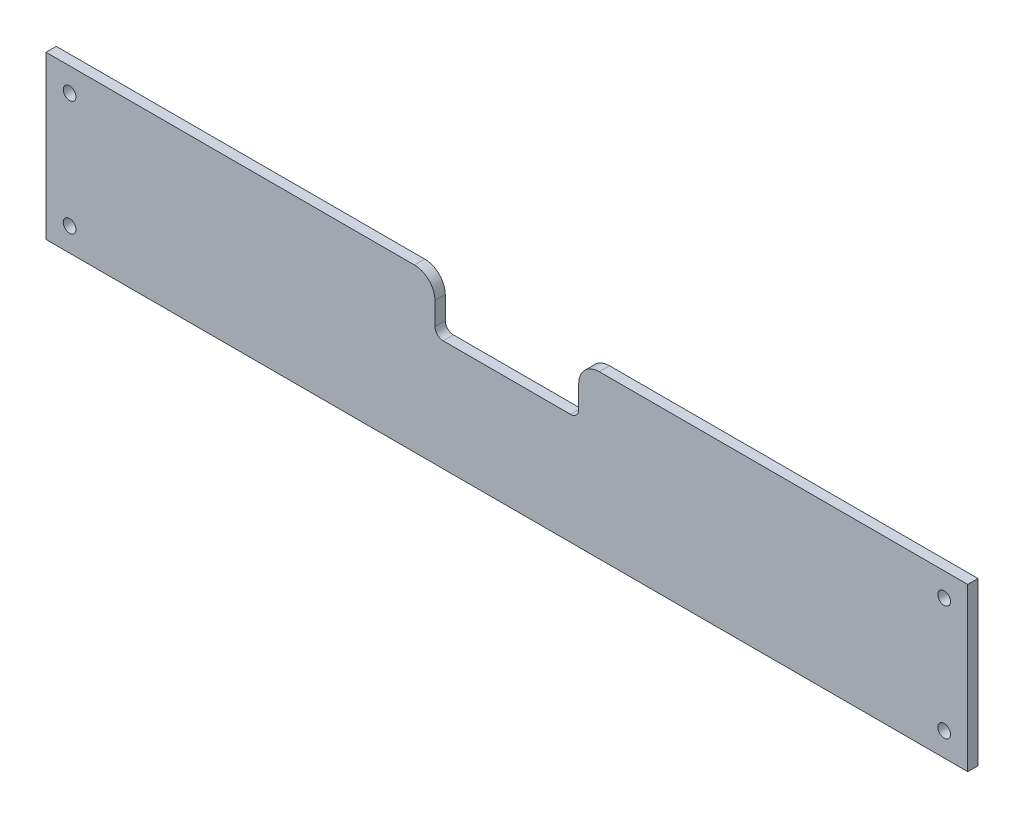
ISO-10303-21;
HEADER;
FILE_DESCRIPTION(('STEP AP214'),'2;1');
FILE_NAME('part.step','',(''),(''),'','','');
FILE_SCHEMA(('AUTOMOTIVE_DESIGN { 1 0 10303 214 1 1 1 1 }'));
ENDSEC;
DATA;
#1=APPLICATION_CONTEXT('core data for automotive mechanical design processes');
#2=APPLICATION_PROTOCOL_DEFINITION('international standard','automotive_design',2000,#1);
#3=PRODUCT_CONTEXT('',#1,'mechanical');
#4=PRODUCT('Part','Part','',(#3));
#5=PRODUCT_RELATED_PRODUCT_CATEGORY('part','',(#4));
#6=PRODUCT_DEFINITION_FORMATION('','',#4);
#7=PRODUCT_DEFINITION_CONTEXT('part definition',#1,'design');
#8=PRODUCT_DEFINITION('design','',#6,#7);
#9=PRODUCT_DEFINITION_SHAPE('','',#8);
#10=(LENGTH_UNIT() NAMED_UNIT(*) SI_UNIT(.MILLI.,.METRE.));
#11=(NAMED_UNIT(*) PLANE_ANGLE_UNIT() SI_UNIT($,.RADIAN.));
#12=(NAMED_UNIT(*) SI_UNIT($,.STERADIAN.) SOLID_ANGLE_UNIT());
#13=UNCERTAINTY_MEASURE_WITH_UNIT(LENGTH_MEASURE(1.E-05),#10,'distance_accuracy_value','');
#14=(GEOMETRIC_REPRESENTATION_CONTEXT(3) GLOBAL_UNCERTAINTY_ASSIGNED_CONTEXT((#13)) GLOBAL_UNIT_ASSIGNED_CONTEXT((#10,
#11,#12)) REPRESENTATION_CONTEXT('',''));
#15=CARTESIAN_POINT('',(0.,0.,0.));
#16=DIRECTION('',(0.,0.,1.));
#17=DIRECTION('',(1.,0.,0.));
#18=AXIS2_PLACEMENT_3D('',#15,#16,#17);
#19=CARTESIAN_POINT('',(179.5,69.,5.));
#20=DIRECTION('',(0.,0.,1.));
#21=DIRECTION('',(1.,0.,0.));
#22=AXIS2_PLACEMENT_3D('',#19,#20,#21);
#23=PLANE('',#22);
#24=CARTESIAN_POINT('',(11.5,11.5,5.));
#25=DIRECTION('',(0.,0.,1.));
#26=DIRECTION('',(-1.,0.,0.));
#27=AXIS2_PLACEMENT_3D('',#24,#25,#26);
#28=CIRCLE('',#27,3.1);
#29=CARTESIAN_POINT('',(8.4,11.5,5.));
#30=VERTEX_POINT('',#29);
#31=EDGE_CURVE('E293',#30,#30,#28,.T.);
#32=ORIENTED_EDGE('',*,*,#31,.F.);
#33=EDGE_LOOP('',(#32));
#34=FACE_BOUND('',#33,.T.);
#35=CARTESIAN_POINT('',(11.5,67.5,5.));
#36=DIRECTION('',(0.,0.,1.));
#37=DIRECTION('',(1.,0.,0.));
#38=AXIS2_PLACEMENT_3D('',#35,#36,#37);
#39=CIRCLE('',#38,3.1);
#40=CARTESIAN_POINT('',(14.6,67.5,5.));
#41=VERTEX_POINT('',#40);
#42=EDGE_CURVE('E171',#41,#41,#39,.T.);
#43=ORIENTED_EDGE('',*,*,#42,.F.);
#44=EDGE_LOOP('',(#43));
#45=FACE_BOUND('',#44,.T.);
#46=DIRECTION('',(1.,0.,0.));
#47=VECTOR('',#46,1.);
#48=CARTESIAN_POINT('',(449.,0.,5.));
#49=LINE('',#48,#47);
#50=CARTESIAN_POINT('',(0.,0.,5.));
#51=VERTEX_POINT('',#50);
#52=CARTESIAN_POINT('',(449.,0.,5.));
#53=VERTEX_POINT('',#52);
#54=EDGE_CURVE('E190',#51,#53,#49,.T.);
#55=ORIENTED_EDGE('',*,*,#54,.T.);
#56=DIRECTION('',(0.,1.,0.));
#57=VECTOR('',#56,1.);
#58=CARTESIAN_POINT('',(449.,79.,5.));
#59=LINE('',#58,#57);
#60=CARTESIAN_POINT('',(449.,79.,5.));
#61=VERTEX_POINT('',#60);
#62=EDGE_CURVE('E116',#53,#61,#59,.T.);
#63=ORIENTED_EDGE('',*,*,#62,.T.);
#64=DIRECTION('',(-1.,0.,0.));
#65=VECTOR('',#64,1.);
#66=CARTESIAN_POINT('',(269.5,79.,5.));
#67=LINE('',#66,#65);
#68=CARTESIAN_POINT('',(269.5,79.,5.));
#69=VERTEX_POINT('',#68);
#70=EDGE_CURVE('E217',#61,#69,#67,.T.);
#71=ORIENTED_EDGE('',*,*,#70,.T.);
#72=CARTESIAN_POINT('',(269.5,69.,5.));
#73=DIRECTION('',(0.,0.,1.));
#74=DIRECTION('',(-1.,0.,0.));
#75=AXIS2_PLACEMENT_3D('',#72,#73,#74);
#76=CIRCLE('',#75,10.);
#77=CARTESIAN_POINT('',(259.5,68.9999999999999,5.));
#78=VERTEX_POINT('',#77);
#79=EDGE_CURVE('E237',#69,#78,#76,.T.);
#80=ORIENTED_EDGE('',*,*,#79,.T.);
#81=DIRECTION('',(0.,-1.,0.));
#82=VECTOR('',#81,1.);
#83=CARTESIAN_POINT('',(259.5,58.,5.));
#84=LINE('',#83,#82);
#85=CARTESIAN_POINT('',(259.5,58.,5.));
#86=VERTEX_POINT('',#85);
#87=EDGE_CURVE('E233',#78,#86,#84,.T.);
#88=ORIENTED_EDGE('',*,*,#87,.T.);
#89=CARTESIAN_POINT('',(255.5,58.,5.));
#90=DIRECTION('',(0.,0.,-1.));
#91=DIRECTION('',(-1.,0.,0.));
#92=AXIS2_PLACEMENT_3D('',#89,#90,#91);
#93=CIRCLE('',#92,4.);
#94=CARTESIAN_POINT('',(255.5,54.,5.));
#95=VERTEX_POINT('',#94);
#96=EDGE_CURVE('E236',#86,#95,#93,.T.);
#97=ORIENTED_EDGE('',*,*,#96,.T.);
#98=DIRECTION('',(-1.,0.,0.));
#99=VECTOR('',#98,1.);
#100=CARTESIAN_POINT('',(255.5,54.,5.));
#101=LINE('',#100,#99);
#102=CARTESIAN_POINT('',(193.5,54.,5.));
#103=VERTEX_POINT('',#102);
#104=EDGE_CURVE('E241',#95,#103,#101,.T.);
#105=ORIENTED_EDGE('',*,*,#104,.T.);
#106=CARTESIAN_POINT('',(193.5,58.,5.));
#107=DIRECTION('',(0.,0.,-1.));
#108=DIRECTION('',(1.,0.,0.));
#109=AXIS2_PLACEMENT_3D('',#106,#107,#108);
#110=CIRCLE('',#109,4.);
#111=CARTESIAN_POINT('',(189.5,58.,5.));
#112=VERTEX_POINT('',#111);
#113=EDGE_CURVE('E339',#103,#112,#110,.T.);
#114=ORIENTED_EDGE('',*,*,#113,.T.);
#115=DIRECTION('',(0.,1.,0.));
#116=VECTOR('',#115,1.);
#117=CARTESIAN_POINT('',(189.5,58.,5.));
#118=LINE('',#117,#116);
#119=CARTESIAN_POINT('',(189.5,68.9999999999999,5.));
#120=VERTEX_POINT('',#119);
#121=EDGE_CURVE('E147',#112,#120,#118,.T.);
#122=ORIENTED_EDGE('',*,*,#121,.T.);
#123=CARTESIAN_POINT('',(179.5,69.,5.));
#124=DIRECTION('',(0.,0.,1.));
#125=DIRECTION('',(1.,0.,0.));
#126=AXIS2_PLACEMENT_3D('',#123,#124,#125);
#127=CIRCLE('',#126,10.);
#128=CARTESIAN_POINT('',(179.5,79.,5.));
#129=VERTEX_POINT('',#128);
#130=EDGE_CURVE('E141',#120,#129,#127,.T.);
#131=ORIENTED_EDGE('',*,*,#130,.T.);
#132=DIRECTION('',(-1.,0.,0.));
#133=VECTOR('',#132,1.);
#134=CARTESIAN_POINT('',(0.,79.,5.));
#135=LINE('',#134,#133);
#136=CARTESIAN_POINT('',(0.,79.,5.));
#137=VERTEX_POINT('',#136);
#138=EDGE_CURVE('E145',#129,#137,#135,.T.);
#139=ORIENTED_EDGE('',*,*,#138,.T.);
#140=DIRECTION('',(0.,-1.,0.));
#141=VECTOR('',#140,1.);
#142=CARTESIAN_POINT('',(0.,0.,5.));
#143=LINE('',#142,#141);
#144=EDGE_CURVE('E61',#137,#51,#143,.T.);
#145=ORIENTED_EDGE('',*,*,#144,.T.);
#146=EDGE_LOOP('',(#55,#63,#71,#80,#88,#97,#105,#114,#122,#131,#139,#145));
#147=FACE_BOUND('',#146,.T.);
#148=CARTESIAN_POINT('',(437.5,67.5,5.));
#149=DIRECTION('',(0.,0.,1.));
#150=DIRECTION('',(-1.,0.,0.));
#151=AXIS2_PLACEMENT_3D('',#148,#149,#150);
#152=CIRCLE('',#151,3.09999999999999);
#153=CARTESIAN_POINT('',(434.4,67.5,5.));
#154=VERTEX_POINT('',#153);
#155=EDGE_CURVE('E311',#154,#154,#152,.T.);
#156=ORIENTED_EDGE('',*,*,#155,.F.);
#157=EDGE_LOOP('',(#156));
#158=FACE_BOUND('',#157,.T.);
#159=CARTESIAN_POINT('',(437.5,11.5,5.));
#160=DIRECTION('',(0.,0.,1.));
#161=DIRECTION('',(1.,0.,0.));
#162=AXIS2_PLACEMENT_3D('',#159,#160,#161);
#163=CIRCLE('',#162,3.09999999999999);
#164=CARTESIAN_POINT('',(440.6,11.5,5.));
#165=VERTEX_POINT('',#164);
#166=EDGE_CURVE('E323',#165,#165,#163,.T.);
#167=ORIENTED_EDGE('',*,*,#166,.F.);
#168=EDGE_LOOP('',(#167));
#169=FACE_BOUND('',#168,.T.);
#170=ADVANCED_FACE('F43',(#34,#45,#147,#158,#169),#23,.T.);
#171=CARTESIAN_POINT('',(179.5,69.,0.));
#172=DIRECTION('',(0.,0.,1.));
#173=DIRECTION('',(1.,0.,0.));
#174=AXIS2_PLACEMENT_3D('',#171,#172,#173);
#175=PLANE('',#174);
#176=DIRECTION('',(1.,0.,0.));
#177=VECTOR('',#176,1.);
#178=CARTESIAN_POINT('',(449.,0.,0.));
#179=LINE('',#178,#177);
#180=CARTESIAN_POINT('',(0.,0.,0.));
#181=VERTEX_POINT('',#180);
#182=CARTESIAN_POINT('',(449.,0.,0.));
#183=VERTEX_POINT('',#182);
#184=EDGE_CURVE('E167',#181,#183,#179,.T.);
#185=ORIENTED_EDGE('',*,*,#184,.F.);
#186=DIRECTION('',(0.,-1.,0.));
#187=VECTOR('',#186,1.);
#188=CARTESIAN_POINT('',(0.,0.,0.));
#189=LINE('',#188,#187);
#190=CARTESIAN_POINT('',(0.,79.,0.));
#191=VERTEX_POINT('',#190);
#192=EDGE_CURVE('E108',#191,#181,#189,.T.);
#193=ORIENTED_EDGE('',*,*,#192,.F.);
#194=DIRECTION('',(-1.,0.,0.));
#195=VECTOR('',#194,1.);
#196=CARTESIAN_POINT('',(0.,79.,0.));
#197=LINE('',#196,#195);
#198=CARTESIAN_POINT('',(179.5,79.,0.));
#199=VERTEX_POINT('',#198);
#200=EDGE_CURVE('E102',#199,#191,#197,.T.);
#201=ORIENTED_EDGE('',*,*,#200,.F.);
#202=CARTESIAN_POINT('',(179.5,69.,0.));
#203=DIRECTION('',(0.,0.,1.));
#204=DIRECTION('',(1.,0.,0.));
#205=AXIS2_PLACEMENT_3D('',#202,#203,#204);
#206=CIRCLE('',#205,10.);
#207=CARTESIAN_POINT('',(189.5,68.9999999999999,0.));
#208=VERTEX_POINT('',#207);
#209=EDGE_CURVE('E156',#208,#199,#206,.T.);
#210=ORIENTED_EDGE('',*,*,#209,.F.);
#211=DIRECTION('',(0.,1.,0.));
#212=VECTOR('',#211,1.);
#213=CARTESIAN_POINT('',(189.5,58.,0.));
#214=LINE('',#213,#212);
#215=CARTESIAN_POINT('',(189.5,58.,0.));
#216=VERTEX_POINT('',#215);
#217=EDGE_CURVE('E185',#216,#208,#214,.T.);
#218=ORIENTED_EDGE('',*,*,#217,.F.);
#219=CARTESIAN_POINT('',(193.5,58.,0.));
#220=DIRECTION('',(0.,0.,-1.));
#221=DIRECTION('',(1.,0.,0.));
#222=AXIS2_PLACEMENT_3D('',#219,#220,#221);
#223=CIRCLE('',#222,4.);
#224=CARTESIAN_POINT('',(193.5,54.,0.));
#225=VERTEX_POINT('',#224);
#226=EDGE_CURVE('E183',#225,#216,#223,.T.);
#227=ORIENTED_EDGE('',*,*,#226,.F.);
#228=DIRECTION('',(-1.,0.,0.));
#229=VECTOR('',#228,1.);
#230=CARTESIAN_POINT('',(255.5,54.,0.));
#231=LINE('',#230,#229);
#232=CARTESIAN_POINT('',(255.5,54.,0.));
#233=VERTEX_POINT('',#232);
#234=EDGE_CURVE('E181',#233,#225,#231,.T.);
#235=ORIENTED_EDGE('',*,*,#234,.F.);
#236=CARTESIAN_POINT('',(255.5,58.,0.));
#237=DIRECTION('',(0.,0.,-1.));
#238=DIRECTION('',(-1.,0.,0.));
#239=AXIS2_PLACEMENT_3D('',#236,#237,#238);
#240=CIRCLE('',#239,4.);
#241=CARTESIAN_POINT('',(259.5,58.,0.));
#242=VERTEX_POINT('',#241);
#243=EDGE_CURVE('E179',#242,#233,#240,.T.);
#244=ORIENTED_EDGE('',*,*,#243,.F.);
#245=DIRECTION('',(0.,-1.,0.));
#246=VECTOR('',#245,1.);
#247=CARTESIAN_POINT('',(259.5,58.,0.));
#248=LINE('',#247,#246);
#249=CARTESIAN_POINT('',(259.5,68.9999999999999,0.));
#250=VERTEX_POINT('',#249);
#251=EDGE_CURVE('E177',#250,#242,#248,.T.);
#252=ORIENTED_EDGE('',*,*,#251,.F.);
#253=CARTESIAN_POINT('',(269.5,69.,0.));
#254=DIRECTION('',(0.,0.,1.));
#255=DIRECTION('',(-1.,0.,0.));
#256=AXIS2_PLACEMENT_3D('',#253,#254,#255);
#257=CIRCLE('',#256,10.);
#258=CARTESIAN_POINT('',(269.5,79.,0.));
#259=VERTEX_POINT('',#258);
#260=EDGE_CURVE('E175',#259,#250,#257,.T.);
#261=ORIENTED_EDGE('',*,*,#260,.F.);
#262=DIRECTION('',(-1.,0.,0.));
#263=VECTOR('',#262,1.);
#264=CARTESIAN_POINT('',(269.5,79.,0.));
#265=LINE('',#264,#263);
#266=CARTESIAN_POINT('',(449.,79.,0.));
#267=VERTEX_POINT('',#266);
#268=EDGE_CURVE('E173',#267,#259,#265,.T.);
#269=ORIENTED_EDGE('',*,*,#268,.F.);
#270=DIRECTION('',(0.,1.,0.));
#271=VECTOR('',#270,1.);
#272=CARTESIAN_POINT('',(449.,79.,0.));
#273=LINE('',#272,#271);
#274=EDGE_CURVE('E170',#183,#267,#273,.T.);
#275=ORIENTED_EDGE('',*,*,#274,.F.);
#276=EDGE_LOOP('',(#185,#193,#201,#210,#218,#227,#235,#244,#252,#261,#269,#275));
#277=FACE_BOUND('',#276,.T.);
#278=CARTESIAN_POINT('',(11.5,67.5,0.));
#279=DIRECTION('',(0.,0.,1.));
#280=DIRECTION('',(1.,0.,0.));
#281=AXIS2_PLACEMENT_3D('',#278,#279,#280);
#282=CIRCLE('',#281,3.1);
#283=CARTESIAN_POINT('',(14.6,67.5,0.));
#284=VERTEX_POINT('',#283);
#285=EDGE_CURVE('E275',#284,#284,#282,.T.);
#286=ORIENTED_EDGE('',*,*,#285,.T.);
#287=EDGE_LOOP('',(#286));
#288=FACE_BOUND('',#287,.T.);
#289=CARTESIAN_POINT('',(437.5,67.5,0.));
#290=DIRECTION('',(0.,0.,1.));
#291=DIRECTION('',(-1.,0.,0.));
#292=AXIS2_PLACEMENT_3D('',#289,#290,#291);
#293=CIRCLE('',#292,3.09999999999999);
#294=CARTESIAN_POINT('',(434.4,67.5,0.));
#295=VERTEX_POINT('',#294);
#296=EDGE_CURVE('E276',#295,#295,#293,.T.);
#297=ORIENTED_EDGE('',*,*,#296,.T.);
#298=EDGE_LOOP('',(#297));
#299=FACE_BOUND('',#298,.T.);
#300=CARTESIAN_POINT('',(11.5,11.5,0.));
#301=DIRECTION('',(0.,0.,1.));
#302=DIRECTION('',(-1.,0.,0.));
#303=AXIS2_PLACEMENT_3D('',#300,#301,#302);
#304=CIRCLE('',#303,3.1);
#305=CARTESIAN_POINT('',(8.4,11.5,0.));
#306=VERTEX_POINT('',#305);
#307=EDGE_CURVE('E299',#306,#306,#304,.T.);
#308=ORIENTED_EDGE('',*,*,#307,.T.);
#309=EDGE_LOOP('',(#308));
#310=FACE_BOUND('',#309,.T.);
#311=CARTESIAN_POINT('',(437.5,11.5,0.));
#312=DIRECTION('',(0.,0.,1.));
#313=DIRECTION('',(1.,0.,0.));
#314=AXIS2_PLACEMENT_3D('',#311,#312,#313);
#315=CIRCLE('',#314,3.09999999999999);
#316=CARTESIAN_POINT('',(440.6,11.5,0.));
#317=VERTEX_POINT('',#316);
#318=EDGE_CURVE('E300',#317,#317,#315,.T.);
#319=ORIENTED_EDGE('',*,*,#318,.T.);
#320=EDGE_LOOP('',(#319));
#321=FACE_BOUND('',#320,.T.);
#322=ADVANCED_FACE('F221',(#277,#288,#299,#310,#321),#175,.F.);
#323=CARTESIAN_POINT('',(449.,0.,5.));
#324=DIRECTION('',(0.,1.,0.));
#325=DIRECTION('',(-1.,0.,0.));
#326=AXIS2_PLACEMENT_3D('',#323,#324,#325);
#327=PLANE('',#326);
#328=ORIENTED_EDGE('',*,*,#184,.T.);
#329=DIRECTION('',(0.,0.,-1.));
#330=VECTOR('',#329,1.);
#331=CARTESIAN_POINT('',(449.,0.,5.));
#332=LINE('',#331,#330);
#333=EDGE_CURVE('E12',#53,#183,#332,.T.);
#334=ORIENTED_EDGE('',*,*,#333,.F.);
#335=ORIENTED_EDGE('',*,*,#54,.F.);
#336=DIRECTION('',(0.,0.,-1.));
#337=VECTOR('',#336,1.);
#338=CARTESIAN_POINT('',(0.,0.,5.));
#339=LINE('',#338,#337);
#340=EDGE_CURVE('E162',#51,#181,#339,.T.);
#341=ORIENTED_EDGE('',*,*,#340,.T.);
#342=EDGE_LOOP('',(#328,#334,#335,#341));
#343=FACE_BOUND('',#342,.T.);
#344=ADVANCED_FACE('F45',(#343),#327,.F.);
#345=CARTESIAN_POINT('',(449.,79.,5.));
#346=DIRECTION('',(-1.,0.,0.));
#347=DIRECTION('',(0.,0.,1.));
#348=AXIS2_PLACEMENT_3D('',#345,#346,#347);
#349=PLANE('',#348);
#350=ORIENTED_EDGE('',*,*,#274,.T.);
#351=DIRECTION('',(0.,0.,-1.));
#352=VECTOR('',#351,1.);
#353=CARTESIAN_POINT('',(449.,79.,5.));
#354=LINE('',#353,#352);
#355=EDGE_CURVE('E52',#61,#267,#354,.T.);
#356=ORIENTED_EDGE('',*,*,#355,.F.);
#357=ORIENTED_EDGE('',*,*,#62,.F.);
#358=ORIENTED_EDGE('',*,*,#333,.T.);
#359=EDGE_LOOP('',(#350,#356,#357,#358));
#360=FACE_BOUND('',#359,.T.);
#361=ADVANCED_FACE('F509',(#360),#349,.F.);
#362=CARTESIAN_POINT('',(269.5,79.,5.));
#363=DIRECTION('',(0.,-1.,0.));
#364=DIRECTION('',(0.,0.,-1.));
#365=AXIS2_PLACEMENT_3D('',#362,#363,#364);
#366=PLANE('',#365);
#367=ORIENTED_EDGE('',*,*,#268,.T.);
#368=DIRECTION('',(0.,0.,-1.));
#369=VECTOR('',#368,1.);
#370=CARTESIAN_POINT('',(269.5,79.,5.));
#371=LINE('',#370,#369);
#372=EDGE_CURVE('E209',#69,#259,#371,.T.);
#373=ORIENTED_EDGE('',*,*,#372,.F.);
#374=ORIENTED_EDGE('',*,*,#70,.F.);
#375=ORIENTED_EDGE('',*,*,#355,.T.);
#376=EDGE_LOOP('',(#367,#373,#374,#375));
#377=FACE_BOUND('',#376,.T.);
#378=ADVANCED_FACE('F215',(#377),#366,.F.);
#379=CARTESIAN_POINT('',(269.5,69.,5.));
#380=DIRECTION('',(0.,0.,-1.));
#381=DIRECTION('',(-1.,0.,0.));
#382=AXIS2_PLACEMENT_3D('',#379,#380,#381);
#383=CYLINDRICAL_SURFACE('',#382,10.);
#384=ORIENTED_EDGE('',*,*,#260,.T.);
#385=DIRECTION('',(0.,0.,-1.));
#386=VECTOR('',#385,1.);
#387=CARTESIAN_POINT('',(259.5,68.9999999999999,5.));
#388=LINE('',#387,#386);
#389=EDGE_CURVE('E206',#78,#250,#388,.T.);
#390=ORIENTED_EDGE('',*,*,#389,.F.);
#391=ORIENTED_EDGE('',*,*,#79,.F.);
#392=ORIENTED_EDGE('',*,*,#372,.T.);
#393=EDGE_LOOP('',(#384,#390,#391,#392));
#394=FACE_BOUND('',#393,.T.);
#395=ADVANCED_FACE('F227',(#394),#383,.T.);
#396=CARTESIAN_POINT('',(259.5,58.,5.));
#397=DIRECTION('',(1.,0.,0.));
#398=DIRECTION('',(0.,0.,-1.));
#399=AXIS2_PLACEMENT_3D('',#396,#397,#398);
#400=PLANE('',#399);
#401=ORIENTED_EDGE('',*,*,#251,.T.);
#402=DIRECTION('',(0.,0.,-1.));
#403=VECTOR('',#402,1.);
#404=CARTESIAN_POINT('',(259.5,58.,5.));
#405=LINE('',#404,#403);
#406=EDGE_CURVE('E203',#86,#242,#405,.T.);
#407=ORIENTED_EDGE('',*,*,#406,.F.);
#408=ORIENTED_EDGE('',*,*,#87,.F.);
#409=ORIENTED_EDGE('',*,*,#389,.T.);
#410=EDGE_LOOP('',(#401,#407,#408,#409));
#411=FACE_BOUND('',#410,.T.);
#412=ADVANCED_FACE('F231',(#411),#400,.F.);
#413=CARTESIAN_POINT('',(255.5,58.,5.));
#414=DIRECTION('',(0.,0.,-1.));
#415=DIRECTION('',(-1.,0.,0.));
#416=AXIS2_PLACEMENT_3D('',#413,#414,#415);
#417=CYLINDRICAL_SURFACE('',#416,4.);
#418=ORIENTED_EDGE('',*,*,#243,.T.);
#419=DIRECTION('',(0.,0.,-1.));
#420=VECTOR('',#419,1.);
#421=CARTESIAN_POINT('',(255.5,54.,5.));
#422=LINE('',#421,#420);
#423=EDGE_CURVE('E200',#95,#233,#422,.T.);
#424=ORIENTED_EDGE('',*,*,#423,.F.);
#425=ORIENTED_EDGE('',*,*,#96,.F.);
#426=ORIENTED_EDGE('',*,*,#406,.T.);
#427=EDGE_LOOP('',(#418,#424,#425,#426));
#428=FACE_BOUND('',#427,.T.);
#429=ADVANCED_FACE('F474',(#428),#417,.F.);
#430=CARTESIAN_POINT('',(255.5,54.,5.));
#431=DIRECTION('',(0.,-1.,0.));
#432=DIRECTION('',(0.,0.,-1.));
#433=AXIS2_PLACEMENT_3D('',#430,#431,#432);
#434=PLANE('',#433);
#435=ORIENTED_EDGE('',*,*,#234,.T.);
#436=DIRECTION('',(0.,0.,-1.));
#437=VECTOR('',#436,1.);
#438=CARTESIAN_POINT('',(193.5,54.,5.));
#439=LINE('',#438,#437);
#440=EDGE_CURVE('E197',#103,#225,#439,.T.);
#441=ORIENTED_EDGE('',*,*,#440,.F.);
#442=ORIENTED_EDGE('',*,*,#104,.F.);
#443=ORIENTED_EDGE('',*,*,#423,.T.);
#444=EDGE_LOOP('',(#435,#441,#442,#443));
#445=FACE_BOUND('',#444,.T.);
#446=ADVANCED_FACE('F465',(#445),#434,.F.);
#447=CARTESIAN_POINT('',(193.5,58.,5.));
#448=DIRECTION('',(0.,0.,-1.));
#449=DIRECTION('',(-1.,0.,0.));
#450=AXIS2_PLACEMENT_3D('',#447,#448,#449);
#451=CYLINDRICAL_SURFACE('',#450,4.);
#452=ORIENTED_EDGE('',*,*,#226,.T.);
#453=DIRECTION('',(0.,0.,-1.));
#454=VECTOR('',#453,1.);
#455=CARTESIAN_POINT('',(189.5,58.,5.));
#456=LINE('',#455,#454);
#457=EDGE_CURVE('E194',#112,#216,#456,.T.);
#458=ORIENTED_EDGE('',*,*,#457,.F.);
#459=ORIENTED_EDGE('',*,*,#113,.F.);
#460=ORIENTED_EDGE('',*,*,#440,.T.);
#461=EDGE_LOOP('',(#452,#458,#459,#460));
#462=FACE_BOUND('',#461,.T.);
#463=ADVANCED_FACE('F370',(#462),#451,.F.);
#464=CARTESIAN_POINT('',(189.5,58.,5.));
#465=DIRECTION('',(-1.,0.,0.));
#466=DIRECTION('',(0.,0.,1.));
#467=AXIS2_PLACEMENT_3D('',#464,#465,#466);
#468=PLANE('',#467);
#469=ORIENTED_EDGE('',*,*,#217,.T.);
#470=DIRECTION('',(0.,0.,-1.));
#471=VECTOR('',#470,1.);
#472=CARTESIAN_POINT('',(189.5,68.9999999999999,5.));
#473=LINE('',#472,#471);
#474=EDGE_CURVE('E157',#120,#208,#473,.T.);
#475=ORIENTED_EDGE('',*,*,#474,.F.);
#476=ORIENTED_EDGE('',*,*,#121,.F.);
#477=ORIENTED_EDGE('',*,*,#457,.T.);
#478=EDGE_LOOP('',(#469,#475,#476,#477));
#479=FACE_BOUND('',#478,.T.);
#480=ADVANCED_FACE('F374',(#479),#468,.F.);
#481=CARTESIAN_POINT('',(179.5,69.,5.));
#482=DIRECTION('',(0.,0.,-1.));
#483=DIRECTION('',(-1.,0.,0.));
#484=AXIS2_PLACEMENT_3D('',#481,#482,#483);
#485=CYLINDRICAL_SURFACE('',#484,10.);
#486=ORIENTED_EDGE('',*,*,#209,.T.);
#487=DIRECTION('',(0.,0.,-1.));
#488=VECTOR('',#487,1.);
#489=CARTESIAN_POINT('',(179.5,79.,5.));
#490=LINE('',#489,#488);
#491=EDGE_CURVE('E153',#129,#199,#490,.T.);
#492=ORIENTED_EDGE('',*,*,#491,.F.);
#493=ORIENTED_EDGE('',*,*,#130,.F.);
#494=ORIENTED_EDGE('',*,*,#474,.T.);
#495=EDGE_LOOP('',(#486,#492,#493,#494));
#496=FACE_BOUND('',#495,.T.);
#497=ADVANCED_FACE('F154',(#496),#485,.T.);
#498=CARTESIAN_POINT('',(0.,79.,5.));
#499=DIRECTION('',(0.,-1.,0.));
#500=DIRECTION('',(0.,0.,-1.));
#501=AXIS2_PLACEMENT_3D('',#498,#499,#500);
#502=PLANE('',#501);
#503=ORIENTED_EDGE('',*,*,#200,.T.);
#504=DIRECTION('',(0.,0.,-1.));
#505=VECTOR('',#504,1.);
#506=CARTESIAN_POINT('',(0.,79.,5.));
#507=LINE('',#506,#505);
#508=EDGE_CURVE('E158',#137,#191,#507,.T.);
#509=ORIENTED_EDGE('',*,*,#508,.F.);
#510=ORIENTED_EDGE('',*,*,#138,.F.);
#511=ORIENTED_EDGE('',*,*,#491,.T.);
#512=EDGE_LOOP('',(#503,#509,#510,#511));
#513=FACE_BOUND('',#512,.T.);
#514=ADVANCED_FACE('F160',(#513),#502,.F.);
#515=CARTESIAN_POINT('',(0.,0.,5.));
#516=DIRECTION('',(1.,0.,0.));
#517=DIRECTION('',(0.,1.,0.));
#518=AXIS2_PLACEMENT_3D('',#515,#516,#517);
#519=PLANE('',#518);
#520=ORIENTED_EDGE('',*,*,#192,.T.);
#521=ORIENTED_EDGE('',*,*,#340,.F.);
#522=ORIENTED_EDGE('',*,*,#144,.F.);
#523=ORIENTED_EDGE('',*,*,#508,.T.);
#524=EDGE_LOOP('',(#520,#521,#522,#523));
#525=FACE_BOUND('',#524,.T.);
#526=ADVANCED_FACE('F378',(#525),#519,.F.);
#527=CARTESIAN_POINT('',(11.5,67.5,5.));
#528=DIRECTION('',(0.,0.,-1.));
#529=DIRECTION('',(-1.,0.,0.));
#530=AXIS2_PLACEMENT_3D('',#527,#528,#529);
#531=CYLINDRICAL_SURFACE('',#530,3.1);
#532=ORIENTED_EDGE('',*,*,#42,.T.);
#533=EDGE_LOOP('',(#532));
#534=FACE_BOUND('',#533,.T.);
#535=ORIENTED_EDGE('',*,*,#285,.F.);
#536=EDGE_LOOP('',(#535));
#537=FACE_BOUND('',#536,.T.);
#538=ADVANCED_FACE('F380',(#534,#537),#531,.F.);
#539=CARTESIAN_POINT('',(437.5,67.5,5.));
#540=DIRECTION('',(0.,0.,-1.));
#541=DIRECTION('',(-1.,0.,0.));
#542=AXIS2_PLACEMENT_3D('',#539,#540,#541);
#543=CYLINDRICAL_SURFACE('',#542,3.09999999999999);
#544=ORIENTED_EDGE('',*,*,#155,.T.);
#545=EDGE_LOOP('',(#544));
#546=FACE_BOUND('',#545,.T.);
#547=ORIENTED_EDGE('',*,*,#296,.F.);
#548=EDGE_LOOP('',(#547));
#549=FACE_BOUND('',#548,.T.);
#550=ADVANCED_FACE('F386',(#546,#549),#543,.F.);
#551=CARTESIAN_POINT('',(11.5,11.5,5.));
#552=DIRECTION('',(0.,0.,-1.));
#553=DIRECTION('',(-1.,0.,0.));
#554=AXIS2_PLACEMENT_3D('',#551,#552,#553);
#555=CYLINDRICAL_SURFACE('',#554,3.1);
#556=ORIENTED_EDGE('',*,*,#31,.T.);
#557=EDGE_LOOP('',(#556));
#558=FACE_BOUND('',#557,.T.);
#559=ORIENTED_EDGE('',*,*,#307,.F.);
#560=EDGE_LOOP('',(#559));
#561=FACE_BOUND('',#560,.T.);
#562=ADVANCED_FACE('F402',(#558,#561),#555,.F.);
#563=CARTESIAN_POINT('',(437.5,11.5,5.));
#564=DIRECTION('',(0.,0.,-1.));
#565=DIRECTION('',(-1.,0.,0.));
#566=AXIS2_PLACEMENT_3D('',#563,#564,#565);
#567=CYLINDRICAL_SURFACE('',#566,3.09999999999999);
#568=ORIENTED_EDGE('',*,*,#166,.T.);
#569=EDGE_LOOP('',(#568));
#570=FACE_BOUND('',#569,.T.);
#571=ORIENTED_EDGE('',*,*,#318,.F.);
#572=EDGE_LOOP('',(#571));
#573=FACE_BOUND('',#572,.T.);
#574=ADVANCED_FACE('F406',(#570,#573),#567,.F.);
#575=CLOSED_SHELL('',(#170,#322,#344,#361,#378,#395,#412,#429,#446,#463,#480,#497,#514,#526,
#538,#550,#562,#574));
#576=MANIFOLD_SOLID_BREP('B2',#575);
#577=ADVANCED_BREP_SHAPE_REPRESENTATION('',(#18,#576),#14);
#578=SHAPE_DEFINITION_REPRESENTATION(#9,#577);
ENDSEC;
END-ISO-10303-21;
